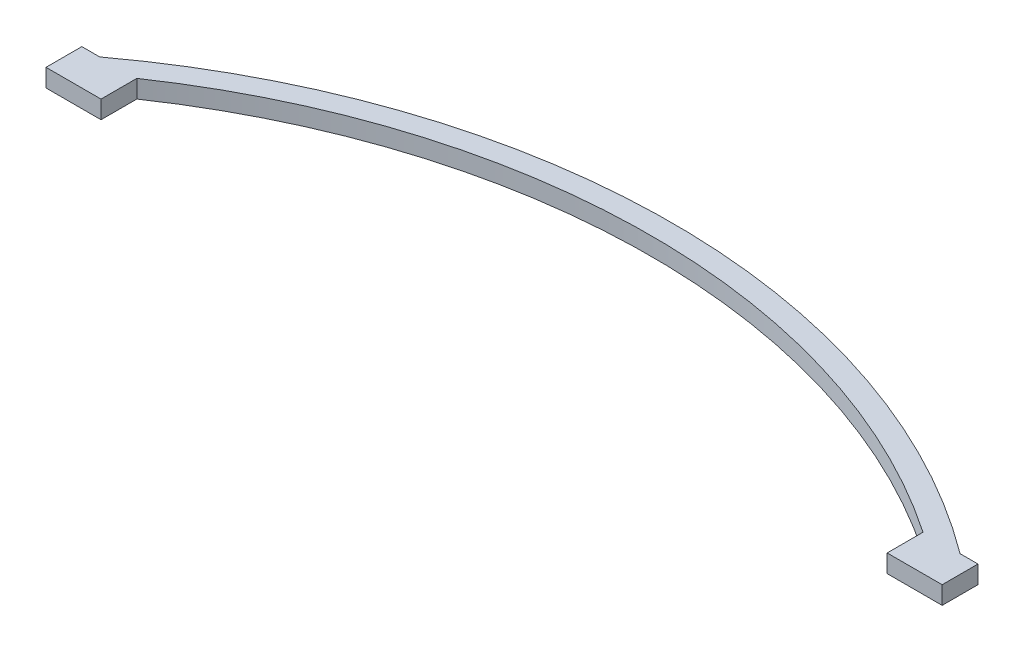
ISO-10303-21;
HEADER;
FILE_DESCRIPTION(('STEP AP214'),'2;1');
FILE_NAME('part.step','',(''),(''),'','','');
FILE_SCHEMA(('AUTOMOTIVE_DESIGN { 1 0 10303 214 1 1 1 1 }'));
ENDSEC;
DATA;
#1=APPLICATION_CONTEXT('core data for automotive mechanical design processes');
#2=APPLICATION_PROTOCOL_DEFINITION('international standard','automotive_design',2000,#1);
#3=PRODUCT_CONTEXT('',#1,'mechanical');
#4=PRODUCT('Part','Part','',(#3));
#5=PRODUCT_RELATED_PRODUCT_CATEGORY('part','',(#4));
#6=PRODUCT_DEFINITION_FORMATION('','',#4);
#7=PRODUCT_DEFINITION_CONTEXT('part definition',#1,'design');
#8=PRODUCT_DEFINITION('design','',#6,#7);
#9=PRODUCT_DEFINITION_SHAPE('','',#8);
#10=(LENGTH_UNIT() NAMED_UNIT(*) SI_UNIT(.MILLI.,.METRE.));
#11=(NAMED_UNIT(*) PLANE_ANGLE_UNIT() SI_UNIT($,.RADIAN.));
#12=(NAMED_UNIT(*) SI_UNIT($,.STERADIAN.) SOLID_ANGLE_UNIT());
#13=UNCERTAINTY_MEASURE_WITH_UNIT(LENGTH_MEASURE(1.E-05),#10,'distance_accuracy_value','');
#14=(GEOMETRIC_REPRESENTATION_CONTEXT(3) GLOBAL_UNCERTAINTY_ASSIGNED_CONTEXT((#13)) GLOBAL_UNIT_ASSIGNED_CONTEXT((#10,
#11,#12)) REPRESENTATION_CONTEXT('',''));
#15=CARTESIAN_POINT('',(0.,0.,0.));
#16=DIRECTION('',(0.,0.,1.));
#17=DIRECTION('',(1.,0.,0.));
#18=AXIS2_PLACEMENT_3D('',#15,#16,#17);
#19=CARTESIAN_POINT('',(0.,3.175,102.404564183835));
#20=DIRECTION('',(0.,-1.,0.));
#21=DIRECTION('',(0.,0.,-1.));
#22=AXIS2_PLACEMENT_3D('',#19,#20,#21);
#23=CYLINDRICAL_SURFACE('',#22,127.644564183835);
#24=CARTESIAN_POINT('',(0.,0.,102.404564183835));
#25=DIRECTION('',(0.,1.,0.));
#26=DIRECTION('',(0.,0.,-1.));
#27=AXIS2_PLACEMENT_3D('',#24,#25,#26);
#28=CIRCLE('',#27,127.644564183835);
#29=CARTESIAN_POINT('',(76.2,0.,0.));
#30=VERTEX_POINT('',#29);
#31=CARTESIAN_POINT('',(-76.2,0.,0.));
#32=VERTEX_POINT('',#31);
#33=EDGE_CURVE('E66',#30,#32,#28,.T.);
#34=ORIENTED_EDGE('',*,*,#33,.T.);
#35=DIRECTION('',(0.,-1.,0.));
#36=VECTOR('',#35,1.);
#37=CARTESIAN_POINT('',(-76.2,3.175,0.));
#38=LINE('',#37,#36);
#39=CARTESIAN_POINT('',(-76.2,3.175,0.));
#40=VERTEX_POINT('',#39);
#41=EDGE_CURVE('E11',#40,#32,#38,.T.);
#42=ORIENTED_EDGE('',*,*,#41,.F.);
#43=CARTESIAN_POINT('',(0.,3.175,102.404564183835));
#44=DIRECTION('',(0.,1.,0.));
#45=DIRECTION('',(0.,0.,-1.));
#46=AXIS2_PLACEMENT_3D('',#43,#44,#45);
#47=CIRCLE('',#46,127.644564183835);
#48=CARTESIAN_POINT('',(76.2,3.175,0.));
#49=VERTEX_POINT('',#48);
#50=EDGE_CURVE('E56',#49,#40,#47,.T.);
#51=ORIENTED_EDGE('',*,*,#50,.F.);
#52=DIRECTION('',(0.,-1.,0.));
#53=VECTOR('',#52,1.);
#54=CARTESIAN_POINT('',(76.2,3.175,0.));
#55=LINE('',#54,#53);
#56=EDGE_CURVE('E108',#49,#30,#55,.T.);
#57=ORIENTED_EDGE('',*,*,#56,.T.);
#58=EDGE_LOOP('',(#34,#42,#51,#57));
#59=FACE_BOUND('',#58,.T.);
#60=ADVANCED_FACE('F39',(#59),#23,.T.);
#61=CARTESIAN_POINT('',(0.,3.175,102.404564183835));
#62=DIRECTION('',(0.,-1.,0.));
#63=DIRECTION('',(0.,0.,-1.));
#64=AXIS2_PLACEMENT_3D('',#61,#62,#63);
#65=CYLINDRICAL_SURFACE('',#64,123.834564183835);
#66=CARTESIAN_POINT('',(0.,0.,102.404564183835));
#67=DIRECTION('',(0.,-1.,0.));
#68=DIRECTION('',(0.,0.,-1.));
#69=AXIS2_PLACEMENT_3D('',#66,#67,#68);
#70=CIRCLE('',#69,123.834564183835);
#71=CARTESIAN_POINT('',(-69.6297674914916,0.,0.));
#72=VERTEX_POINT('',#71);
#73=CARTESIAN_POINT('',(69.6297674914916,0.,0.));
#74=VERTEX_POINT('',#73);
#75=EDGE_CURVE('E130',#72,#74,#70,.T.);
#76=ORIENTED_EDGE('',*,*,#75,.T.);
#77=DIRECTION('',(0.,-1.,0.));
#78=VECTOR('',#77,1.);
#79=CARTESIAN_POINT('',(69.6297674914916,3.175,0.));
#80=LINE('',#79,#78);
#81=CARTESIAN_POINT('',(69.6297674914916,3.175,0.));
#82=VERTEX_POINT('',#81);
#83=EDGE_CURVE('E103',#82,#74,#80,.T.);
#84=ORIENTED_EDGE('',*,*,#83,.F.);
#85=CARTESIAN_POINT('',(0.,3.175,102.404564183835));
#86=DIRECTION('',(0.,-1.,0.));
#87=DIRECTION('',(0.,0.,-1.));
#88=AXIS2_PLACEMENT_3D('',#85,#86,#87);
#89=CIRCLE('',#88,123.834564183835);
#90=CARTESIAN_POINT('',(-69.6297674914916,3.175,0.));
#91=VERTEX_POINT('',#90);
#92=EDGE_CURVE('E97',#91,#82,#89,.T.);
#93=ORIENTED_EDGE('',*,*,#92,.F.);
#94=DIRECTION('',(0.,-1.,0.));
#95=VECTOR('',#94,1.);
#96=CARTESIAN_POINT('',(-69.6297674914916,3.175,0.));
#97=LINE('',#96,#95);
#98=EDGE_CURVE('E48',#91,#72,#97,.T.);
#99=ORIENTED_EDGE('',*,*,#98,.T.);
#100=EDGE_LOOP('',(#76,#84,#93,#99));
#101=FACE_BOUND('',#100,.T.);
#102=ADVANCED_FACE('F99',(#101),#65,.F.);
#103=CARTESIAN_POINT('',(0.,3.175,102.404564183835));
#104=DIRECTION('',(0.,-1.,0.));
#105=DIRECTION('',(0.,0.,-1.));
#106=AXIS2_PLACEMENT_3D('',#103,#104,#105);
#107=PLANE('',#106);
#108=ORIENTED_EDGE('',*,*,#50,.T.);
#109=DIRECTION('',(-1.,0.,0.));
#110=VECTOR('',#109,1.);
#111=CARTESIAN_POINT('',(-69.6297674914916,3.175,0.));
#112=LINE('',#111,#110);
#113=CARTESIAN_POINT('',(-79.375,3.175,0.));
#114=VERTEX_POINT('',#113);
#115=EDGE_CURVE('E154',#40,#114,#112,.T.);
#116=ORIENTED_EDGE('',*,*,#115,.T.);
#117=DIRECTION('',(0.,0.,-1.));
#118=VECTOR('',#117,1.);
#119=CARTESIAN_POINT('',(-79.375,3.175,6.35));
#120=LINE('',#119,#118);
#121=CARTESIAN_POINT('',(-79.375,3.175,6.35));
#122=VERTEX_POINT('',#121);
#123=EDGE_CURVE('E120',#122,#114,#120,.T.);
#124=ORIENTED_EDGE('',*,*,#123,.F.);
#125=DIRECTION('',(-1.,0.,0.));
#126=VECTOR('',#125,1.);
#127=CARTESIAN_POINT('',(-69.6297674914916,3.175,6.35));
#128=LINE('',#127,#126);
#129=CARTESIAN_POINT('',(-69.6297674914916,3.175,6.35));
#130=VERTEX_POINT('',#129);
#131=EDGE_CURVE('E116',#130,#122,#128,.T.);
#132=ORIENTED_EDGE('',*,*,#131,.F.);
#133=DIRECTION('',(0.,0.,-1.));
#134=VECTOR('',#133,1.);
#135=CARTESIAN_POINT('',(-69.6297674914916,3.175,6.35));
#136=LINE('',#135,#134);
#137=EDGE_CURVE('E112',#130,#91,#136,.T.);
#138=ORIENTED_EDGE('',*,*,#137,.T.);
#139=ORIENTED_EDGE('',*,*,#92,.T.);
#140=DIRECTION('',(0.,0.,-1.));
#141=VECTOR('',#140,1.);
#142=CARTESIAN_POINT('',(69.6297674914917,3.17500000000002,6.35));
#143=LINE('',#142,#141);
#144=CARTESIAN_POINT('',(69.6297674914917,3.17500000000002,6.35));
#145=VERTEX_POINT('',#144);
#146=EDGE_CURVE('E178',#145,#82,#143,.T.);
#147=ORIENTED_EDGE('',*,*,#146,.F.);
#148=DIRECTION('',(-1.,0.,0.));
#149=VECTOR('',#148,1.);
#150=CARTESIAN_POINT('',(69.6297674914917,3.17500000000002,6.35));
#151=LINE('',#150,#149);
#152=CARTESIAN_POINT('',(79.375,3.175,6.35));
#153=VERTEX_POINT('',#152);
#154=EDGE_CURVE('E181',#153,#145,#151,.T.);
#155=ORIENTED_EDGE('',*,*,#154,.F.);
#156=DIRECTION('',(0.,0.,-1.));
#157=VECTOR('',#156,1.);
#158=CARTESIAN_POINT('',(79.375,3.175,6.35));
#159=LINE('',#158,#157);
#160=CARTESIAN_POINT('',(79.375,3.175,0.));
#161=VERTEX_POINT('',#160);
#162=EDGE_CURVE('E174',#153,#161,#159,.T.);
#163=ORIENTED_EDGE('',*,*,#162,.T.);
#164=DIRECTION('',(-1.,0.,0.));
#165=VECTOR('',#164,1.);
#166=CARTESIAN_POINT('',(69.6297674914917,3.17500000000002,0.));
#167=LINE('',#166,#165);
#168=EDGE_CURVE('E182',#161,#49,#167,.T.);
#169=ORIENTED_EDGE('',*,*,#168,.T.);
#170=EDGE_LOOP('',(#108,#116,#124,#132,#138,#139,#147,#155,#163,#169));
#171=FACE_BOUND('',#170,.T.);
#172=ADVANCED_FACE('F113',(#171),#107,.F.);
#173=CARTESIAN_POINT('',(0.,0.,102.404564183835));
#174=DIRECTION('',(0.,-1.,0.));
#175=DIRECTION('',(0.,0.,-1.));
#176=AXIS2_PLACEMENT_3D('',#173,#174,#175);
#177=PLANE('',#176);
#178=ORIENTED_EDGE('',*,*,#33,.F.);
#179=DIRECTION('',(1.,0.,0.));
#180=VECTOR('',#179,1.);
#181=CARTESIAN_POINT('',(69.6297674914917,0.,0.));
#182=LINE('',#181,#180);
#183=CARTESIAN_POINT('',(79.375,0.,0.));
#184=VERTEX_POINT('',#183);
#185=EDGE_CURVE('E191',#30,#184,#182,.T.);
#186=ORIENTED_EDGE('',*,*,#185,.T.);
#187=DIRECTION('',(0.,0.,-1.));
#188=VECTOR('',#187,1.);
#189=CARTESIAN_POINT('',(79.375,0.,6.35));
#190=LINE('',#189,#188);
#191=CARTESIAN_POINT('',(79.375,0.,6.35));
#192=VERTEX_POINT('',#191);
#193=EDGE_CURVE('E170',#192,#184,#190,.T.);
#194=ORIENTED_EDGE('',*,*,#193,.F.);
#195=DIRECTION('',(1.,0.,0.));
#196=VECTOR('',#195,1.);
#197=CARTESIAN_POINT('',(69.6297674914917,0.,6.35));
#198=LINE('',#197,#196);
#199=CARTESIAN_POINT('',(69.6297674914917,0.,6.35));
#200=VERTEX_POINT('',#199);
#201=EDGE_CURVE('E202',#200,#192,#198,.T.);
#202=ORIENTED_EDGE('',*,*,#201,.F.);
#203=DIRECTION('',(0.,0.,-1.));
#204=VECTOR('',#203,1.);
#205=CARTESIAN_POINT('',(69.6297674914917,0.,6.35));
#206=LINE('',#205,#204);
#207=EDGE_CURVE('E157',#200,#74,#206,.T.);
#208=ORIENTED_EDGE('',*,*,#207,.T.);
#209=ORIENTED_EDGE('',*,*,#75,.F.);
#210=DIRECTION('',(0.,0.,-1.));
#211=VECTOR('',#210,1.);
#212=CARTESIAN_POINT('',(-69.6297674914916,0.,6.35));
#213=LINE('',#212,#211);
#214=CARTESIAN_POINT('',(-69.6297674914916,0.,6.35));
#215=VERTEX_POINT('',#214);
#216=EDGE_CURVE('E123',#215,#72,#213,.T.);
#217=ORIENTED_EDGE('',*,*,#216,.F.);
#218=DIRECTION('',(1.,0.,0.));
#219=VECTOR('',#218,1.);
#220=CARTESIAN_POINT('',(-69.6297674914916,0.,6.35));
#221=LINE('',#220,#219);
#222=CARTESIAN_POINT('',(-79.375,0.,6.35));
#223=VERTEX_POINT('',#222);
#224=EDGE_CURVE('E76',#223,#215,#221,.T.);
#225=ORIENTED_EDGE('',*,*,#224,.F.);
#226=DIRECTION('',(0.,0.,-1.));
#227=VECTOR('',#226,1.);
#228=CARTESIAN_POINT('',(-79.375,0.,6.35));
#229=LINE('',#228,#227);
#230=CARTESIAN_POINT('',(-79.375,0.,0.));
#231=VERTEX_POINT('',#230);
#232=EDGE_CURVE('E140',#223,#231,#229,.T.);
#233=ORIENTED_EDGE('',*,*,#232,.T.);
#234=DIRECTION('',(1.,0.,0.));
#235=VECTOR('',#234,1.);
#236=CARTESIAN_POINT('',(-69.6297674914916,0.,0.));
#237=LINE('',#236,#235);
#238=EDGE_CURVE('E146',#231,#32,#237,.T.);
#239=ORIENTED_EDGE('',*,*,#238,.T.);
#240=EDGE_LOOP('',(#178,#186,#194,#202,#208,#209,#217,#225,#233,#239));
#241=FACE_BOUND('',#240,.T.);
#242=ADVANCED_FACE('F223',(#241),#177,.T.);
#243=CARTESIAN_POINT('',(0.,0.,0.));
#244=DIRECTION('',(0.,0.,-1.));
#245=DIRECTION('',(-1.,0.,0.));
#246=AXIS2_PLACEMENT_3D('',#243,#244,#245);
#247=PLANE('',#246);
#248=ORIENTED_EDGE('',*,*,#41,.T.);
#249=ORIENTED_EDGE('',*,*,#238,.F.);
#250=DIRECTION('',(0.,-1.,0.));
#251=VECTOR('',#250,1.);
#252=CARTESIAN_POINT('',(-79.375,3.175,0.));
#253=LINE('',#252,#251);
#254=EDGE_CURVE('E151',#114,#231,#253,.T.);
#255=ORIENTED_EDGE('',*,*,#254,.F.);
#256=ORIENTED_EDGE('',*,*,#115,.F.);
#257=EDGE_LOOP('',(#248,#249,#255,#256));
#258=FACE_BOUND('',#257,.T.);
#259=ADVANCED_FACE('F248',(#258),#247,.T.);
#260=CARTESIAN_POINT('',(-69.6297674914916,3.175,6.35));
#261=DIRECTION('',(-1.,0.,0.));
#262=DIRECTION('',(0.,0.,1.));
#263=AXIS2_PLACEMENT_3D('',#260,#261,#262);
#264=PLANE('',#263);
#265=ORIENTED_EDGE('',*,*,#98,.F.);
#266=ORIENTED_EDGE('',*,*,#137,.F.);
#267=DIRECTION('',(0.,1.,0.));
#268=VECTOR('',#267,1.);
#269=CARTESIAN_POINT('',(-69.6297674914916,3.175,6.35));
#270=LINE('',#269,#268);
#271=EDGE_CURVE('E150',#215,#130,#270,.T.);
#272=ORIENTED_EDGE('',*,*,#271,.F.);
#273=ORIENTED_EDGE('',*,*,#216,.T.);
#274=EDGE_LOOP('',(#265,#266,#272,#273));
#275=FACE_BOUND('',#274,.T.);
#276=ADVANCED_FACE('F122',(#275),#264,.F.);
#277=CARTESIAN_POINT('',(-79.375,3.175,6.35));
#278=DIRECTION('',(1.,0.,0.));
#279=DIRECTION('',(0.,0.,-1.));
#280=AXIS2_PLACEMENT_3D('',#277,#278,#279);
#281=PLANE('',#280);
#282=ORIENTED_EDGE('',*,*,#254,.T.);
#283=ORIENTED_EDGE('',*,*,#232,.F.);
#284=DIRECTION('',(0.,-1.,0.));
#285=VECTOR('',#284,1.);
#286=CARTESIAN_POINT('',(-79.375,3.175,6.35));
#287=LINE('',#286,#285);
#288=EDGE_CURVE('E160',#122,#223,#287,.T.);
#289=ORIENTED_EDGE('',*,*,#288,.F.);
#290=ORIENTED_EDGE('',*,*,#123,.T.);
#291=EDGE_LOOP('',(#282,#283,#289,#290));
#292=FACE_BOUND('',#291,.T.);
#293=ADVANCED_FACE('F245',(#292),#281,.F.);
#294=CARTESIAN_POINT('',(0.,0.,6.35));
#295=DIRECTION('',(0.,0.,-1.));
#296=DIRECTION('',(-1.,0.,0.));
#297=AXIS2_PLACEMENT_3D('',#294,#295,#296);
#298=PLANE('',#297);
#299=ORIENTED_EDGE('',*,*,#271,.T.);
#300=ORIENTED_EDGE('',*,*,#131,.T.);
#301=ORIENTED_EDGE('',*,*,#288,.T.);
#302=ORIENTED_EDGE('',*,*,#224,.T.);
#303=EDGE_LOOP('',(#299,#300,#301,#302));
#304=FACE_BOUND('',#303,.T.);
#305=ADVANCED_FACE('F239',(#304),#298,.F.);
#306=CARTESIAN_POINT('',(0.,0.,0.));
#307=DIRECTION('',(0.,0.,1.));
#308=DIRECTION('',(1.,0.,0.));
#309=AXIS2_PLACEMENT_3D('',#306,#307,#308);
#310=PLANE('',#309);
#311=ORIENTED_EDGE('',*,*,#185,.F.);
#312=ORIENTED_EDGE('',*,*,#56,.F.);
#313=ORIENTED_EDGE('',*,*,#168,.F.);
#314=DIRECTION('',(0.,1.,0.));
#315=VECTOR('',#314,1.);
#316=CARTESIAN_POINT('',(79.375,3.175,0.));
#317=LINE('',#316,#315);
#318=EDGE_CURVE('E187',#184,#161,#317,.T.);
#319=ORIENTED_EDGE('',*,*,#318,.F.);
#320=EDGE_LOOP('',(#311,#312,#313,#319));
#321=FACE_BOUND('',#320,.T.);
#322=ADVANCED_FACE('F268',(#321),#310,.F.);
#323=CARTESIAN_POINT('',(69.6297674914917,3.17500000000002,6.35));
#324=DIRECTION('',(1.,0.,0.));
#325=DIRECTION('',(0.,0.,-1.));
#326=AXIS2_PLACEMENT_3D('',#323,#324,#325);
#327=PLANE('',#326);
#328=ORIENTED_EDGE('',*,*,#83,.T.);
#329=ORIENTED_EDGE('',*,*,#207,.F.);
#330=DIRECTION('',(0.,-1.,0.));
#331=VECTOR('',#330,1.);
#332=CARTESIAN_POINT('',(69.6297674914917,3.17500000000002,6.35));
#333=LINE('',#332,#331);
#334=EDGE_CURVE('E186',#145,#200,#333,.T.);
#335=ORIENTED_EDGE('',*,*,#334,.F.);
#336=ORIENTED_EDGE('',*,*,#146,.T.);
#337=EDGE_LOOP('',(#328,#329,#335,#336));
#338=FACE_BOUND('',#337,.T.);
#339=ADVANCED_FACE('F221',(#338),#327,.F.);
#340=CARTESIAN_POINT('',(79.375,3.175,6.35));
#341=DIRECTION('',(-1.,0.,0.));
#342=DIRECTION('',(0.,0.,1.));
#343=AXIS2_PLACEMENT_3D('',#340,#341,#342);
#344=PLANE('',#343);
#345=ORIENTED_EDGE('',*,*,#318,.T.);
#346=ORIENTED_EDGE('',*,*,#162,.F.);
#347=DIRECTION('',(0.,1.,0.));
#348=VECTOR('',#347,1.);
#349=CARTESIAN_POINT('',(79.375,3.175,6.35));
#350=LINE('',#349,#348);
#351=EDGE_CURVE('E198',#192,#153,#350,.T.);
#352=ORIENTED_EDGE('',*,*,#351,.F.);
#353=ORIENTED_EDGE('',*,*,#193,.T.);
#354=EDGE_LOOP('',(#345,#346,#352,#353));
#355=FACE_BOUND('',#354,.T.);
#356=ADVANCED_FACE('F232',(#355),#344,.F.);
#357=CARTESIAN_POINT('',(0.,0.,6.35));
#358=DIRECTION('',(0.,0.,1.));
#359=DIRECTION('',(1.,0.,0.));
#360=AXIS2_PLACEMENT_3D('',#357,#358,#359);
#361=PLANE('',#360);
#362=ORIENTED_EDGE('',*,*,#334,.T.);
#363=ORIENTED_EDGE('',*,*,#201,.T.);
#364=ORIENTED_EDGE('',*,*,#351,.T.);
#365=ORIENTED_EDGE('',*,*,#154,.T.);
#366=EDGE_LOOP('',(#362,#363,#364,#365));
#367=FACE_BOUND('',#366,.T.);
#368=ADVANCED_FACE('F212',(#367),#361,.T.);
#369=CLOSED_SHELL('',(#60,#102,#172,#242,#259,#276,#293,#305,#322,#339,#356,#368));
#370=MANIFOLD_SOLID_BREP('B2',#369);
#371=ADVANCED_BREP_SHAPE_REPRESENTATION('',(#18,#370),#14);
#372=SHAPE_DEFINITION_REPRESENTATION(#9,#371);
ENDSEC;
END-ISO-10303-21;
